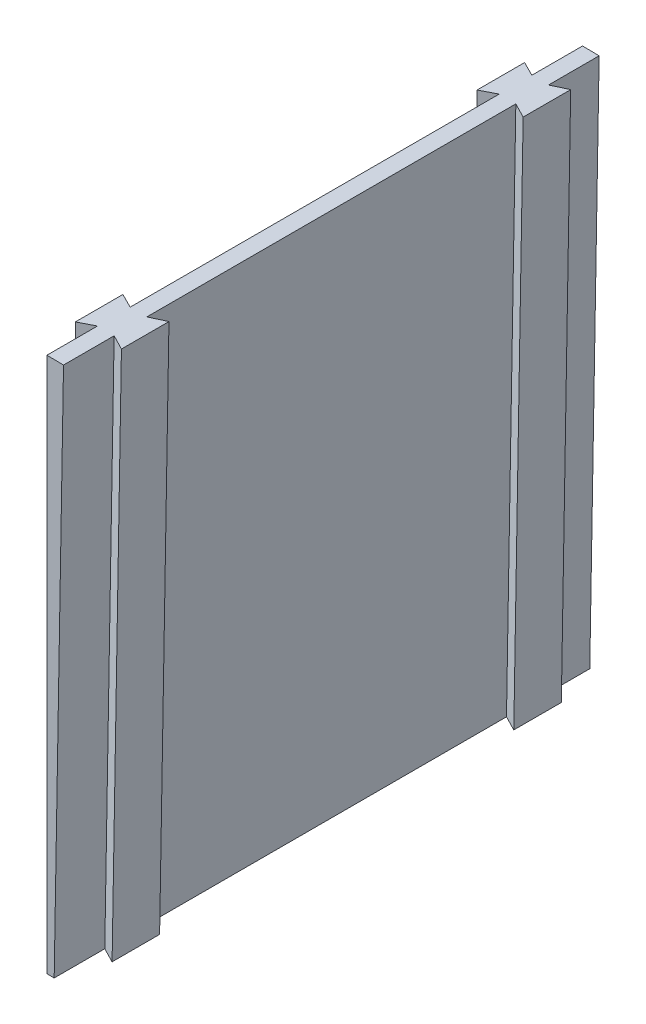
ISO-10303-21;
HEADER;
FILE_DESCRIPTION(('STEP AP214'),'2;1');
FILE_NAME('part.step','',(''),(''),'','','');
FILE_SCHEMA(('AUTOMOTIVE_DESIGN { 1 0 10303 214 1 1 1 1 }'));
ENDSEC;
DATA;
#1=APPLICATION_CONTEXT('core data for automotive mechanical design processes');
#2=APPLICATION_PROTOCOL_DEFINITION('international standard','automotive_design',2000,#1);
#3=PRODUCT_CONTEXT('',#1,'mechanical');
#4=PRODUCT('Part','Part','',(#3));
#5=PRODUCT_RELATED_PRODUCT_CATEGORY('part','',(#4));
#6=PRODUCT_DEFINITION_FORMATION('','',#4);
#7=PRODUCT_DEFINITION_CONTEXT('part definition',#1,'design');
#8=PRODUCT_DEFINITION('design','',#6,#7);
#9=PRODUCT_DEFINITION_SHAPE('','',#8);
#10=(LENGTH_UNIT() NAMED_UNIT(*) SI_UNIT(.MILLI.,.METRE.));
#11=(NAMED_UNIT(*) PLANE_ANGLE_UNIT() SI_UNIT($,.RADIAN.));
#12=(NAMED_UNIT(*) SI_UNIT($,.STERADIAN.) SOLID_ANGLE_UNIT());
#13=UNCERTAINTY_MEASURE_WITH_UNIT(LENGTH_MEASURE(1.E-05),#10,'distance_accuracy_value','');
#14=(GEOMETRIC_REPRESENTATION_CONTEXT(3) GLOBAL_UNCERTAINTY_ASSIGNED_CONTEXT((#13)) GLOBAL_UNIT_ASSIGNED_CONTEXT((#10,
#11,#12)) REPRESENTATION_CONTEXT('',''));
#15=CARTESIAN_POINT('',(0.,0.,0.));
#16=DIRECTION('',(0.,0.,1.));
#17=DIRECTION('',(1.,0.,0.));
#18=AXIS2_PLACEMENT_3D('',#15,#16,#17);
#19=CARTESIAN_POINT('',(0.,79.375,101.6));
#20=DIRECTION('',(1.,0.,0.));
#21=DIRECTION('',(0.,0.,-1.));
#22=AXIS2_PLACEMENT_3D('',#19,#20,#21);
#23=PLANE('',#22);
#24=DIRECTION('',(0.,0.,-1.));
#25=VECTOR('',#24,1.);
#26=CARTESIAN_POINT('',(0.,180.975,101.6));
#27=LINE('',#26,#25);
#28=CARTESIAN_POINT('',(0.,180.975,85.7997919351432));
#29=VERTEX_POINT('',#28);
#30=CARTESIAN_POINT('',(0.,180.975,15.8002080648568));
#31=VERTEX_POINT('',#30);
#32=EDGE_CURVE('E191',#29,#31,#27,.T.);
#33=ORIENTED_EDGE('',*,*,#32,.T.);
#34=DIRECTION('',(0.,-1.,0.));
#35=VECTOR('',#34,1.);
#36=CARTESIAN_POINT('',(0.,180.976,15.8002080648568));
#37=LINE('',#36,#35);
#38=CARTESIAN_POINT('',(0.,79.375,15.8002080648568));
#39=VERTEX_POINT('',#38);
#40=EDGE_CURVE('E68',#31,#39,#37,.T.);
#41=ORIENTED_EDGE('',*,*,#40,.T.);
#42=DIRECTION('',(0.,0.,-1.));
#43=VECTOR('',#42,1.);
#44=CARTESIAN_POINT('',(0.,79.375,101.6));
#45=LINE('',#44,#43);
#46=CARTESIAN_POINT('',(0.,79.375,85.7997919351432));
#47=VERTEX_POINT('',#46);
#48=EDGE_CURVE('E363',#47,#39,#45,.T.);
#49=ORIENTED_EDGE('',*,*,#48,.F.);
#50=DIRECTION('',(0.,-1.,0.));
#51=VECTOR('',#50,1.);
#52=CARTESIAN_POINT('',(0.,180.976,85.7997919351432));
#53=LINE('',#52,#51);
#54=EDGE_CURVE('E221',#29,#47,#53,.T.);
#55=ORIENTED_EDGE('',*,*,#54,.F.);
#56=EDGE_LOOP('',(#33,#41,#49,#55));
#57=FACE_BOUND('',#56,.T.);
#58=ADVANCED_FACE('F43',(#57),#23,.F.);
#59=CARTESIAN_POINT('',(0.,79.375,9.59979193514321));
#60=VERTEX_POINT('',#59);
#61=CARTESIAN_POINT('',(0.,79.375,0.));
#62=VERTEX_POINT('',#61);
#63=EDGE_CURVE('E60',#60,#62,#45,.T.);
#64=ORIENTED_EDGE('',*,*,#63,.F.);
#65=DIRECTION('',(0.,-1.,0.));
#66=VECTOR('',#65,1.);
#67=CARTESIAN_POINT('',(0.,180.976,9.59979193514321));
#68=LINE('',#67,#66);
#69=CARTESIAN_POINT('',(0.,180.975,9.59979193514321));
#70=VERTEX_POINT('',#69);
#71=EDGE_CURVE('E196',#70,#60,#68,.T.);
#72=ORIENTED_EDGE('',*,*,#71,.F.);
#73=CARTESIAN_POINT('',(0.,180.975,0.));
#74=VERTEX_POINT('',#73);
#75=EDGE_CURVE('E182',#70,#74,#27,.T.);
#76=ORIENTED_EDGE('',*,*,#75,.T.);
#77=DIRECTION('',(0.,-1.,0.));
#78=VECTOR('',#77,1.);
#79=CARTESIAN_POINT('',(0.,79.375,0.));
#80=LINE('',#79,#78);
#81=EDGE_CURVE('E341',#74,#62,#80,.T.);
#82=ORIENTED_EDGE('',*,*,#81,.T.);
#83=EDGE_LOOP('',(#64,#72,#76,#82));
#84=FACE_BOUND('',#83,.T.);
#85=ADVANCED_FACE('F197',(#84),#23,.F.);
#86=CARTESIAN_POINT('',(1.38528476095938,79.3629108030386,101.6));
#87=DIRECTION('',(-0.999847695156391,0.0174524064372836,0.));
#88=DIRECTION('',(-0.0174524064372836,-0.999847695156391,0.));
#89=AXIS2_PLACEMENT_3D('',#86,#87,#88);
#90=PLANE('',#89);
#91=DIRECTION('',(0.,0.,-1.));
#92=VECTOR('',#91,1.);
#93=CARTESIAN_POINT('',(1.38528476095938,79.3629108030386,101.6));
#94=LINE('',#93,#92);
#95=CARTESIAN_POINT('',(1.38528476095938,79.3629108030386,85.7997919351432));
#96=VERTEX_POINT('',#95);
#97=CARTESIAN_POINT('',(1.38528476095938,79.3629108030386,15.8002080648568));
#98=VERTEX_POINT('',#97);
#99=EDGE_CURVE('E52',#96,#98,#94,.T.);
#100=ORIENTED_EDGE('',*,*,#99,.T.);
#101=DIRECTION('',(-0.0174524064372835,-0.999847695156391,0.));
#102=VECTOR('',#101,1.);
#103=CARTESIAN_POINT('',(3.15930013999314,180.996183800259,15.8002080648568));
#104=LINE('',#103,#102);
#105=CARTESIAN_POINT('',(3.1584492549874,180.947436630928,15.8002080648568));
#106=VERTEX_POINT('',#105);
#107=EDGE_CURVE('E258',#106,#98,#104,.T.);
#108=ORIENTED_EDGE('',*,*,#107,.F.);
#109=DIRECTION('',(0.,0.,-1.));
#110=VECTOR('',#109,1.);
#111=CARTESIAN_POINT('',(3.15844925498738,180.947436630928,101.6));
#112=LINE('',#111,#110);
#113=CARTESIAN_POINT('',(3.15844925498738,180.947436630928,85.7997919351432));
#114=VERTEX_POINT('',#113);
#115=EDGE_CURVE('E369',#114,#106,#112,.T.);
#116=ORIENTED_EDGE('',*,*,#115,.F.);
#117=DIRECTION('',(-0.0174524064372835,-0.999847695156391,0.));
#118=VECTOR('',#117,1.);
#119=CARTESIAN_POINT('',(3.15930013999314,180.996183800259,85.7997919351432));
#120=LINE('',#119,#118);
#121=EDGE_CURVE('E320',#114,#96,#120,.T.);
#122=ORIENTED_EDGE('',*,*,#121,.T.);
#123=EDGE_LOOP('',(#100,#108,#116,#122));
#124=FACE_BOUND('',#123,.T.);
#125=ADVANCED_FACE('F470',(#124),#90,.F.);
#126=DIRECTION('',(-0.0174524064372835,-0.999847695156391,0.));
#127=VECTOR('',#126,1.);
#128=CARTESIAN_POINT('',(3.15930013999314,180.996183800259,92.0002080648568));
#129=LINE('',#128,#127);
#130=CARTESIAN_POINT('',(3.15844925498738,180.947436630928,92.0002080648568));
#131=VERTEX_POINT('',#130);
#132=CARTESIAN_POINT('',(1.38528476095938,79.3629108030386,92.0002080648568));
#133=VERTEX_POINT('',#132);
#134=EDGE_CURVE('E301',#131,#133,#129,.T.);
#135=ORIENTED_EDGE('',*,*,#134,.F.);
#136=CARTESIAN_POINT('',(3.15844925498738,180.947436630928,101.6));
#137=VERTEX_POINT('',#136);
#138=EDGE_CURVE('E366',#137,#131,#112,.T.);
#139=ORIENTED_EDGE('',*,*,#138,.F.);
#140=DIRECTION('',(0.0174524064372836,0.999847695156391,0.));
#141=VECTOR('',#140,1.);
#142=CARTESIAN_POINT('',(1.38528476095938,79.3629108030386,101.6));
#143=LINE('',#142,#141);
#144=CARTESIAN_POINT('',(1.38528476095938,79.3629108030386,101.6));
#145=VERTEX_POINT('',#144);
#146=EDGE_CURVE('E340',#145,#137,#143,.T.);
#147=ORIENTED_EDGE('',*,*,#146,.F.);
#148=EDGE_CURVE('E11',#145,#133,#94,.T.);
#149=ORIENTED_EDGE('',*,*,#148,.T.);
#150=EDGE_LOOP('',(#135,#139,#147,#149));
#151=FACE_BOUND('',#150,.T.);
#152=ADVANCED_FACE('F449',(#151),#90,.F.);
#153=CARTESIAN_POINT('',(0.,0.,101.6));
#154=DIRECTION('',(0.,0.,-1.));
#155=DIRECTION('',(-1.,0.,0.));
#156=AXIS2_PLACEMENT_3D('',#153,#154,#155);
#157=CYLINDRICAL_SURFACE('',#156,79.375);
#158=CARTESIAN_POINT('',(0.,0.,0.));
#159=DIRECTION('',(0.,0.,-1.));
#160=DIRECTION('',(-1.,0.,0.));
#161=AXIS2_PLACEMENT_3D('',#158,#159,#160);
#162=CIRCLE('',#161,79.375);
#163=CARTESIAN_POINT('',(1.38528476095938,79.3629108030386,0.));
#164=VERTEX_POINT('',#163);
#165=EDGE_CURVE('E335',#62,#164,#162,.T.);
#166=ORIENTED_EDGE('',*,*,#165,.T.);
#167=CARTESIAN_POINT('',(1.38528476095938,79.3629108030386,9.59979193514321));
#168=VERTEX_POINT('',#167);
#169=EDGE_CURVE('E53',#168,#164,#94,.T.);
#170=ORIENTED_EDGE('',*,*,#169,.F.);
#171=DIRECTION('',(0.,0.,-1.));
#172=VECTOR('',#171,1.);
#173=CARTESIAN_POINT('',(1.38528476095938,79.3629108030386,15.8002080648568));
#174=LINE('',#173,#172);
#175=EDGE_CURVE('E280',#98,#168,#174,.T.);
#176=ORIENTED_EDGE('',*,*,#175,.F.);
#177=ORIENTED_EDGE('',*,*,#99,.F.);
#178=DIRECTION('',(0.,0.,-1.));
#179=VECTOR('',#178,1.);
#180=CARTESIAN_POINT('',(1.38528476095938,79.3629108030386,85.7997919351432));
#181=LINE('',#180,#179);
#182=EDGE_CURVE('E288',#133,#96,#181,.T.);
#183=ORIENTED_EDGE('',*,*,#182,.F.);
#184=ORIENTED_EDGE('',*,*,#148,.F.);
#185=CARTESIAN_POINT('',(0.,0.,101.6));
#186=DIRECTION('',(0.,0.,-1.));
#187=DIRECTION('',(-1.,0.,0.));
#188=AXIS2_PLACEMENT_3D('',#185,#186,#187);
#189=CIRCLE('',#188,79.375);
#190=CARTESIAN_POINT('',(0.,79.375,101.6));
#191=VERTEX_POINT('',#190);
#192=EDGE_CURVE('E336',#191,#145,#189,.T.);
#193=ORIENTED_EDGE('',*,*,#192,.F.);
#194=CARTESIAN_POINT('',(0.,79.375,92.0002080648568));
#195=VERTEX_POINT('',#194);
#196=EDGE_CURVE('E192',#191,#195,#45,.T.);
#197=ORIENTED_EDGE('',*,*,#196,.T.);
#198=DIRECTION('',(0.,0.,1.));
#199=VECTOR('',#198,1.);
#200=CARTESIAN_POINT('',(0.,79.375,85.7997919351432));
#201=LINE('',#200,#199);
#202=EDGE_CURVE('E225',#47,#195,#201,.T.);
#203=ORIENTED_EDGE('',*,*,#202,.F.);
#204=ORIENTED_EDGE('',*,*,#48,.T.);
#205=DIRECTION('',(0.,0.,1.));
#206=VECTOR('',#205,1.);
#207=CARTESIAN_POINT('',(0.,79.375,15.8002080648568));
#208=LINE('',#207,#206);
#209=EDGE_CURVE('E389',#60,#39,#208,.T.);
#210=ORIENTED_EDGE('',*,*,#209,.F.);
#211=ORIENTED_EDGE('',*,*,#63,.T.);
#212=EDGE_LOOP('',(#166,#170,#176,#177,#183,#184,#193,#197,#203,#204,#210,#211));
#213=FACE_BOUND('',#212,.T.);
#214=ADVANCED_FACE('F45',(#213),#157,.F.);
#215=CARTESIAN_POINT('',(3.15844925498738,180.947436630928,9.59979193514321));
#216=VERTEX_POINT('',#215);
#217=CARTESIAN_POINT('',(3.15844925498738,180.947436630928,0.));
#218=VERTEX_POINT('',#217);
#219=EDGE_CURVE('E365',#216,#218,#112,.T.);
#220=ORIENTED_EDGE('',*,*,#219,.F.);
#221=DIRECTION('',(-0.0174524064372835,-0.999847695156391,0.));
#222=VECTOR('',#221,1.);
#223=CARTESIAN_POINT('',(3.15930013999314,180.996183800259,9.59979193514321));
#224=LINE('',#223,#222);
#225=EDGE_CURVE('E262',#216,#168,#224,.T.);
#226=ORIENTED_EDGE('',*,*,#225,.T.);
#227=ORIENTED_EDGE('',*,*,#169,.T.);
#228=DIRECTION('',(0.0174524064372836,0.999847695156391,0.));
#229=VECTOR('',#228,1.);
#230=CARTESIAN_POINT('',(1.38528476095938,79.3629108030386,0.));
#231=LINE('',#230,#229);
#232=EDGE_CURVE('E353',#164,#218,#231,.T.);
#233=ORIENTED_EDGE('',*,*,#232,.T.);
#234=EDGE_LOOP('',(#220,#226,#227,#233));
#235=FACE_BOUND('',#234,.T.);
#236=ADVANCED_FACE('F381',(#235),#90,.F.);
#237=CARTESIAN_POINT('',(0.,0.,101.6));
#238=DIRECTION('',(0.,0.,-1.));
#239=DIRECTION('',(-1.,0.,0.));
#240=AXIS2_PLACEMENT_3D('',#237,#238,#239);
#241=CYLINDRICAL_SURFACE('',#240,180.975);
#242=CARTESIAN_POINT('',(0.,0.,0.));
#243=DIRECTION('',(0.,0.,1.));
#244=DIRECTION('',(-1.,0.,0.));
#245=AXIS2_PLACEMENT_3D('',#242,#243,#244);
#246=CIRCLE('',#245,180.975);
#247=EDGE_CURVE('E188',#218,#74,#246,.T.);
#248=ORIENTED_EDGE('',*,*,#247,.T.);
#249=ORIENTED_EDGE('',*,*,#75,.F.);
#250=CARTESIAN_POINT('',(0.,0.,9.59979193514321));
#251=DIRECTION('',(0.450153111117083,0.,-0.892951385323754));
#252=DIRECTION('',(-0.892951385323754,0.,-0.450153111117083));
#253=AXIS2_PLACEMENT_3D('',#250,#251,#252);
#254=ELLIPSE('',#253,202.670607800653,180.975);
#255=CARTESIAN_POINT('',(-2.79357446026696,180.9534375654,8.1915));
#256=VERTEX_POINT('',#255);
#257=EDGE_CURVE('E185',#70,#256,#254,.F.);
#258=ORIENTED_EDGE('',*,*,#257,.T.);
#259=DIRECTION('',(0.,0.,-1.));
#260=VECTOR('',#259,1.);
#261=CARTESIAN_POINT('',(-2.79357446026696,180.9534375654,101.6));
#262=LINE('',#261,#260);
#263=CARTESIAN_POINT('',(-2.79357446026696,180.9534375654,17.2085));
#264=VERTEX_POINT('',#263);
#265=EDGE_CURVE('E213',#256,#264,#262,.F.);
#266=ORIENTED_EDGE('',*,*,#265,.T.);
#267=CARTESIAN_POINT('',(0.,0.,15.8002080648568));
#268=DIRECTION('',(0.450153111117083,0.,0.892951385323754));
#269=DIRECTION('',(0.892951385323754,0.,-0.450153111117083));
#270=AXIS2_PLACEMENT_3D('',#267,#268,#269);
#271=ELLIPSE('',#270,202.670607800653,180.975);
#272=EDGE_CURVE('E207',#264,#31,#271,.F.);
#273=ORIENTED_EDGE('',*,*,#272,.T.);
#274=ORIENTED_EDGE('',*,*,#32,.F.);
#275=CARTESIAN_POINT('',(0.,0.,85.7997919351432));
#276=DIRECTION('',(0.450153111117083,0.,-0.892951385323754));
#277=DIRECTION('',(-0.892951385323754,0.,-0.450153111117083));
#278=AXIS2_PLACEMENT_3D('',#275,#276,#277);
#279=ELLIPSE('',#278,202.670607800653,180.975);
#280=CARTESIAN_POINT('',(-2.79357446026696,180.9534375654,84.3915));
#281=VERTEX_POINT('',#280);
#282=EDGE_CURVE('E220',#29,#281,#279,.F.);
#283=ORIENTED_EDGE('',*,*,#282,.T.);
#284=DIRECTION('',(0.,0.,-1.));
#285=VECTOR('',#284,1.);
#286=CARTESIAN_POINT('',(-2.79357446026696,180.9534375654,101.6));
#287=LINE('',#286,#285);
#288=CARTESIAN_POINT('',(-2.79357446026696,180.9534375654,93.4085));
#289=VERTEX_POINT('',#288);
#290=EDGE_CURVE('E217',#281,#289,#287,.F.);
#291=ORIENTED_EDGE('',*,*,#290,.T.);
#292=CARTESIAN_POINT('',(0.,0.,92.0002080648568));
#293=DIRECTION('',(0.450153111117083,0.,0.892951385323754));
#294=DIRECTION('',(0.892951385323754,0.,-0.450153111117083));
#295=AXIS2_PLACEMENT_3D('',#292,#293,#294);
#296=ELLIPSE('',#295,202.670607800653,180.975);
#297=CARTESIAN_POINT('',(0.,180.975,92.0002080648568));
#298=VERTEX_POINT('',#297);
#299=EDGE_CURVE('E224',#289,#298,#296,.F.);
#300=ORIENTED_EDGE('',*,*,#299,.T.);
#301=CARTESIAN_POINT('',(0.,180.975,101.6));
#302=VERTEX_POINT('',#301);
#303=EDGE_CURVE('E194',#302,#298,#27,.T.);
#304=ORIENTED_EDGE('',*,*,#303,.F.);
#305=CARTESIAN_POINT('',(0.,0.,101.6));
#306=DIRECTION('',(0.,0.,1.));
#307=DIRECTION('',(-1.,0.,0.));
#308=AXIS2_PLACEMENT_3D('',#305,#306,#307);
#309=CIRCLE('',#308,180.975);
#310=EDGE_CURVE('E344',#137,#302,#309,.T.);
#311=ORIENTED_EDGE('',*,*,#310,.F.);
#312=ORIENTED_EDGE('',*,*,#138,.T.);
#313=CARTESIAN_POINT('',(0.,0.,92.0002080648568));
#314=DIRECTION('',(-0.450029888864767,0.00785530092977308,0.892978943411135));
#315=DIRECTION('',(-0.892842938392813,0.0155846314603472,-0.450098441037438));
#316=AXIS2_PLACEMENT_3D('',#313,#314,#315);
#317=ELLIPSE('',#316,202.664353213845,180.975);
#318=CARTESIAN_POINT('',(5.95164728421928,180.877108887787,93.4085));
#319=VERTEX_POINT('',#318);
#320=EDGE_CURVE('E300',#131,#319,#317,.F.);
#321=ORIENTED_EDGE('',*,*,#320,.T.);
#322=DIRECTION('',(0.,0.,-1.));
#323=VECTOR('',#322,1.);
#324=CARTESIAN_POINT('',(5.95164728421928,180.877108887787,101.6));
#325=LINE('',#324,#323);
#326=CARTESIAN_POINT('',(5.95164728421928,180.877108887787,84.3915));
#327=VERTEX_POINT('',#326);
#328=EDGE_CURVE('E297',#319,#327,#325,.T.);
#329=ORIENTED_EDGE('',*,*,#328,.T.);
#330=CARTESIAN_POINT('',(0.,0.,85.7997919351432));
#331=DIRECTION('',(-0.450029888864767,0.00785530092977308,-0.892978943411135));
#332=DIRECTION('',(0.892842938392813,-0.0155846314603472,-0.450098441037438));
#333=AXIS2_PLACEMENT_3D('',#330,#331,#332);
#334=ELLIPSE('',#333,202.664353213845,180.975);
#335=EDGE_CURVE('E304',#327,#114,#334,.F.);
#336=ORIENTED_EDGE('',*,*,#335,.T.);
#337=ORIENTED_EDGE('',*,*,#115,.T.);
#338=CARTESIAN_POINT('',(0.,0.,15.8002080648568));
#339=DIRECTION('',(-0.450029888864767,0.00785530092977308,0.892978943411135));
#340=DIRECTION('',(-0.892842938392813,0.0155846314603472,-0.450098441037438));
#341=AXIS2_PLACEMENT_3D('',#338,#339,#340);
#342=ELLIPSE('',#341,202.664353213845,180.975);
#343=CARTESIAN_POINT('',(5.95164728421928,180.877108887787,17.2085));
#344=VERTEX_POINT('',#343);
#345=EDGE_CURVE('E257',#106,#344,#342,.F.);
#346=ORIENTED_EDGE('',*,*,#345,.T.);
#347=DIRECTION('',(0.,0.,-1.));
#348=VECTOR('',#347,1.);
#349=CARTESIAN_POINT('',(5.95164728421928,180.877108887787,101.6));
#350=LINE('',#349,#348);
#351=CARTESIAN_POINT('',(5.95164728421928,180.877108887787,8.1915));
#352=VERTEX_POINT('',#351);
#353=EDGE_CURVE('E291',#344,#352,#350,.T.);
#354=ORIENTED_EDGE('',*,*,#353,.T.);
#355=CARTESIAN_POINT('',(0.,0.,9.59979193514321));
#356=DIRECTION('',(-0.450029888864767,0.00785530092977308,-0.892978943411135));
#357=DIRECTION('',(0.892842938392813,-0.0155846314603472,-0.450098441037438));
#358=AXIS2_PLACEMENT_3D('',#355,#356,#357);
#359=ELLIPSE('',#358,202.664353213845,180.975);
#360=EDGE_CURVE('E272',#352,#216,#359,.F.);
#361=ORIENTED_EDGE('',*,*,#360,.T.);
#362=ORIENTED_EDGE('',*,*,#219,.T.);
#363=EDGE_LOOP('',(#248,#249,#258,#266,#273,#274,#283,#291,#300,#304,#311,#312,#321,#329,#336,
#337,#346,#354,#361,#362));
#364=FACE_BOUND('',#363,.T.);
#365=ADVANCED_FACE('F183',(#364),#241,.T.);
#366=ORIENTED_EDGE('',*,*,#303,.T.);
#367=DIRECTION('',(0.,-1.,0.));
#368=VECTOR('',#367,1.);
#369=CARTESIAN_POINT('',(0.,180.976,92.0002080648568));
#370=LINE('',#369,#368);
#371=EDGE_CURVE('E242',#298,#195,#370,.T.);
#372=ORIENTED_EDGE('',*,*,#371,.T.);
#373=ORIENTED_EDGE('',*,*,#196,.F.);
#374=DIRECTION('',(0.,-1.,0.));
#375=VECTOR('',#374,1.);
#376=CARTESIAN_POINT('',(0.,79.375,101.6));
#377=LINE('',#376,#375);
#378=EDGE_CURVE('E347',#302,#191,#377,.T.);
#379=ORIENTED_EDGE('',*,*,#378,.F.);
#380=EDGE_LOOP('',(#366,#372,#373,#379));
#381=FACE_BOUND('',#380,.T.);
#382=ADVANCED_FACE('F443',(#381),#23,.F.);
#383=CARTESIAN_POINT('',(0.,0.,101.6));
#384=DIRECTION('',(0.,0.,-1.));
#385=DIRECTION('',(-1.,0.,0.));
#386=AXIS2_PLACEMENT_3D('',#383,#384,#385);
#387=PLANE('',#386);
#388=ORIENTED_EDGE('',*,*,#192,.T.);
#389=ORIENTED_EDGE('',*,*,#146,.T.);
#390=ORIENTED_EDGE('',*,*,#310,.T.);
#391=ORIENTED_EDGE('',*,*,#378,.T.);
#392=EDGE_LOOP('',(#388,#389,#390,#391));
#393=FACE_BOUND('',#392,.T.);
#394=ADVANCED_FACE('F446',(#393),#387,.F.);
#395=CARTESIAN_POINT('',(0.,0.,0.));
#396=DIRECTION('',(0.,0.,-1.));
#397=DIRECTION('',(-1.,0.,0.));
#398=AXIS2_PLACEMENT_3D('',#395,#396,#397);
#399=PLANE('',#398);
#400=ORIENTED_EDGE('',*,*,#165,.F.);
#401=ORIENTED_EDGE('',*,*,#81,.F.);
#402=ORIENTED_EDGE('',*,*,#247,.F.);
#403=ORIENTED_EDGE('',*,*,#232,.F.);
#404=EDGE_LOOP('',(#400,#401,#402,#403));
#405=FACE_BOUND('',#404,.T.);
#406=ADVANCED_FACE('F385',(#405),#399,.T.);
#407=CARTESIAN_POINT('',(3.15930013999314,180.996183800259,92.0002080648568));
#408=DIRECTION('',(-0.450029888864767,0.00785530092977308,0.892978943411135));
#409=DIRECTION('',(0.893006495655164,0.,0.45004377422389));
#410=AXIS2_PLACEMENT_3D('',#407,#408,#409);
#411=PLANE('',#410);
#412=ORIENTED_EDGE('',*,*,#320,.F.);
#413=ORIENTED_EDGE('',*,*,#134,.T.);
#414=DIRECTION('',(-0.892842938392813,0.0155846314603458,-0.450098441037438));
#415=VECTOR('',#414,1.);
#416=CARTESIAN_POINT('',(1.38528476095938,79.3629108030386,92.0002080648568));
#417=LINE('',#416,#415);
#418=CARTESIAN_POINT('',(4.17885922122634,79.3141487794528,93.4085));
#419=VERTEX_POINT('',#418);
#420=EDGE_CURVE('E316',#419,#133,#417,.T.);
#421=ORIENTED_EDGE('',*,*,#420,.F.);
#422=DIRECTION('',(-0.0174524064372835,-0.999847695156391,0.));
#423=VECTOR('',#422,1.);
#424=CARTESIAN_POINT('',(5.9528746002601,180.947421776674,93.4085));
#425=LINE('',#424,#423);
#426=EDGE_CURVE('E324',#319,#419,#425,.T.);
#427=ORIENTED_EDGE('',*,*,#426,.F.);
#428=EDGE_LOOP('',(#412,#413,#421,#427));
#429=FACE_BOUND('',#428,.T.);
#430=ADVANCED_FACE('F453',(#429),#411,.T.);
#431=CARTESIAN_POINT('',(5.9528746002601,180.947421776674,84.3915));
#432=DIRECTION('',(-0.450029888864767,0.00785530092977308,-0.892978943411135));
#433=DIRECTION('',(-0.893006495655164,0.,0.45004377422389));
#434=AXIS2_PLACEMENT_3D('',#431,#432,#433);
#435=PLANE('',#434);
#436=ORIENTED_EDGE('',*,*,#335,.F.);
#437=DIRECTION('',(-0.0174524064372835,-0.999847695156391,0.));
#438=VECTOR('',#437,1.);
#439=CARTESIAN_POINT('',(5.9528746002601,180.947421776674,84.3915));
#440=LINE('',#439,#438);
#441=CARTESIAN_POINT('',(4.17885922122634,79.3141487794528,84.3915));
#442=VERTEX_POINT('',#441);
#443=EDGE_CURVE('E327',#327,#442,#440,.T.);
#444=ORIENTED_EDGE('',*,*,#443,.T.);
#445=DIRECTION('',(0.892842938392813,-0.0155846314603458,-0.450098441037438));
#446=VECTOR('',#445,1.);
#447=CARTESIAN_POINT('',(4.17885922122634,79.3141487794528,84.3915));
#448=LINE('',#447,#446);
#449=EDGE_CURVE('E308',#96,#442,#448,.T.);
#450=ORIENTED_EDGE('',*,*,#449,.F.);
#451=ORIENTED_EDGE('',*,*,#121,.F.);
#452=EDGE_LOOP('',(#436,#444,#450,#451));
#453=FACE_BOUND('',#452,.T.);
#454=ADVANCED_FACE('F466',(#453),#435,.T.);
#455=CARTESIAN_POINT('',(5.9528746002601,180.947421776674,93.4085));
#456=DIRECTION('',(0.999847695156391,-0.0174524064372835,0.));
#457=DIRECTION('',(0.0174524064372836,0.999847695156391,0.));
#458=AXIS2_PLACEMENT_3D('',#455,#456,#457);
#459=PLANE('',#458);
#460=ORIENTED_EDGE('',*,*,#328,.F.);
#461=ORIENTED_EDGE('',*,*,#426,.T.);
#462=DIRECTION('',(0.,0.,1.));
#463=VECTOR('',#462,1.);
#464=CARTESIAN_POINT('',(4.17885922122634,79.3141487794528,93.4085));
#465=LINE('',#464,#463);
#466=EDGE_CURVE('E312',#442,#419,#465,.T.);
#467=ORIENTED_EDGE('',*,*,#466,.F.);
#468=ORIENTED_EDGE('',*,*,#443,.F.);
#469=EDGE_LOOP('',(#460,#461,#467,#468));
#470=FACE_BOUND('',#469,.T.);
#471=ADVANCED_FACE('F462',(#470),#459,.T.);
#472=CARTESIAN_POINT('',(1.38528476095926,79.3629108030386,0.));
#473=DIRECTION('',(0.0174524064372821,0.999847695156391,0.));
#474=DIRECTION('',(-0.999847695156391,0.0174524064372821,0.));
#475=AXIS2_PLACEMENT_3D('',#472,#473,#474);
#476=PLANE('',#475);
#477=ORIENTED_EDGE('',*,*,#182,.T.);
#478=ORIENTED_EDGE('',*,*,#449,.T.);
#479=ORIENTED_EDGE('',*,*,#466,.T.);
#480=ORIENTED_EDGE('',*,*,#420,.T.);
#481=EDGE_LOOP('',(#477,#478,#479,#480));
#482=FACE_BOUND('',#481,.T.);
#483=ADVANCED_FACE('F456',(#482),#476,.F.);
#484=CARTESIAN_POINT('',(5.9528746002601,180.947421776674,17.2085));
#485=DIRECTION('',(-0.450029888864767,0.00785530092977308,0.892978943411135));
#486=DIRECTION('',(0.893006495655164,0.,0.45004377422389));
#487=AXIS2_PLACEMENT_3D('',#484,#485,#486);
#488=PLANE('',#487);
#489=ORIENTED_EDGE('',*,*,#345,.F.);
#490=ORIENTED_EDGE('',*,*,#107,.T.);
#491=DIRECTION('',(-0.892842938392813,0.0155846314603458,-0.450098441037438));
#492=VECTOR('',#491,1.);
#493=CARTESIAN_POINT('',(4.17885922122634,79.3141487794528,17.2085));
#494=LINE('',#493,#492);
#495=CARTESIAN_POINT('',(4.17885922122634,79.3141487794528,17.2085));
#496=VERTEX_POINT('',#495);
#497=EDGE_CURVE('E284',#496,#98,#494,.T.);
#498=ORIENTED_EDGE('',*,*,#497,.F.);
#499=DIRECTION('',(-0.0174524064372835,-0.999847695156391,0.));
#500=VECTOR('',#499,1.);
#501=CARTESIAN_POINT('',(5.9528746002601,180.947421776674,17.2085));
#502=LINE('',#501,#500);
#503=EDGE_CURVE('E269',#344,#496,#502,.T.);
#504=ORIENTED_EDGE('',*,*,#503,.F.);
#505=EDGE_LOOP('',(#489,#490,#498,#504));
#506=FACE_BOUND('',#505,.T.);
#507=ADVANCED_FACE('F485',(#506),#488,.T.);
#508=CARTESIAN_POINT('',(3.15930013999314,180.996183800259,9.59979193514321));
#509=DIRECTION('',(-0.450029888864767,0.00785530092977308,-0.892978943411135));
#510=DIRECTION('',(-0.893006495655164,0.,0.45004377422389));
#511=AXIS2_PLACEMENT_3D('',#508,#509,#510);
#512=PLANE('',#511);
#513=ORIENTED_EDGE('',*,*,#360,.F.);
#514=DIRECTION('',(-0.0174524064372835,-0.999847695156391,0.));
#515=VECTOR('',#514,1.);
#516=CARTESIAN_POINT('',(5.9528746002601,180.947421776674,8.1915));
#517=LINE('',#516,#515);
#518=CARTESIAN_POINT('',(4.17885922122634,79.3141487794528,8.1915));
#519=VERTEX_POINT('',#518);
#520=EDGE_CURVE('E266',#352,#519,#517,.T.);
#521=ORIENTED_EDGE('',*,*,#520,.T.);
#522=DIRECTION('',(0.892842938392813,-0.0155846314603458,-0.450098441037438));
#523=VECTOR('',#522,1.);
#524=CARTESIAN_POINT('',(1.38528476095938,79.3629108030386,9.59979193514321));
#525=LINE('',#524,#523);
#526=EDGE_CURVE('E276',#168,#519,#525,.T.);
#527=ORIENTED_EDGE('',*,*,#526,.F.);
#528=ORIENTED_EDGE('',*,*,#225,.F.);
#529=EDGE_LOOP('',(#513,#521,#527,#528));
#530=FACE_BOUND('',#529,.T.);
#531=ADVANCED_FACE('F478',(#530),#512,.T.);
#532=CARTESIAN_POINT('',(5.9528746002601,180.947421776674,8.1915));
#533=DIRECTION('',(0.999847695156391,-0.0174524064372835,0.));
#534=DIRECTION('',(0.0174524064372836,0.999847695156391,0.));
#535=AXIS2_PLACEMENT_3D('',#532,#533,#534);
#536=PLANE('',#535);
#537=ORIENTED_EDGE('',*,*,#353,.F.);
#538=ORIENTED_EDGE('',*,*,#503,.T.);
#539=DIRECTION('',(0.,0.,1.));
#540=VECTOR('',#539,1.);
#541=CARTESIAN_POINT('',(4.17885922122634,79.3141487794528,8.1915));
#542=LINE('',#541,#540);
#543=EDGE_CURVE('E261',#519,#496,#542,.T.);
#544=ORIENTED_EDGE('',*,*,#543,.F.);
#545=ORIENTED_EDGE('',*,*,#520,.F.);
#546=EDGE_LOOP('',(#537,#538,#544,#545));
#547=FACE_BOUND('',#546,.T.);
#548=ADVANCED_FACE('F482',(#547),#536,.T.);
#549=CARTESIAN_POINT('',(1.38528476095926,79.3629108030386,0.));
#550=DIRECTION('',(-0.0174524064372821,-0.999847695156391,0.));
#551=DIRECTION('',(0.999847695156391,-0.0174524064372821,0.));
#552=AXIS2_PLACEMENT_3D('',#549,#550,#551);
#553=PLANE('',#552);
#554=ORIENTED_EDGE('',*,*,#497,.T.);
#555=ORIENTED_EDGE('',*,*,#175,.T.);
#556=ORIENTED_EDGE('',*,*,#526,.T.);
#557=ORIENTED_EDGE('',*,*,#543,.T.);
#558=EDGE_LOOP('',(#554,#555,#556,#557));
#559=FACE_BOUND('',#558,.T.);
#560=ADVANCED_FACE('F474',(#559),#553,.T.);
#561=CARTESIAN_POINT('',(-2.79357446026696,180.976,84.3915));
#562=DIRECTION('',(0.450153111117083,0.,-0.892951385323754));
#563=DIRECTION('',(-0.892951385323754,0.,-0.450153111117083));
#564=AXIS2_PLACEMENT_3D('',#561,#562,#563);
#565=PLANE('',#564);
#566=ORIENTED_EDGE('',*,*,#282,.F.);
#567=ORIENTED_EDGE('',*,*,#54,.T.);
#568=DIRECTION('',(0.892951385323754,0.,0.450153111117083));
#569=VECTOR('',#568,1.);
#570=CARTESIAN_POINT('',(-2.79357446026696,79.375,84.3915));
#571=LINE('',#570,#569);
#572=CARTESIAN_POINT('',(-2.79357446026696,79.375,84.3915));
#573=VERTEX_POINT('',#572);
#574=EDGE_CURVE('E238',#573,#47,#571,.T.);
#575=ORIENTED_EDGE('',*,*,#574,.F.);
#576=DIRECTION('',(0.,-1.,0.));
#577=VECTOR('',#576,1.);
#578=CARTESIAN_POINT('',(-2.79357446026696,180.976,84.3915));
#579=LINE('',#578,#577);
#580=EDGE_CURVE('E246',#281,#573,#579,.T.);
#581=ORIENTED_EDGE('',*,*,#580,.F.);
#582=EDGE_LOOP('',(#566,#567,#575,#581));
#583=FACE_BOUND('',#582,.T.);
#584=ADVANCED_FACE('F426',(#583),#565,.T.);
#585=CARTESIAN_POINT('',(0.,180.976,92.0002080648568));
#586=DIRECTION('',(0.450153111117083,0.,0.892951385323754));
#587=DIRECTION('',(0.892951385323754,0.,-0.450153111117083));
#588=AXIS2_PLACEMENT_3D('',#585,#586,#587);
#589=PLANE('',#588);
#590=ORIENTED_EDGE('',*,*,#299,.F.);
#591=DIRECTION('',(0.,-1.,0.));
#592=VECTOR('',#591,1.);
#593=CARTESIAN_POINT('',(-2.79357446026696,180.976,93.4085));
#594=LINE('',#593,#592);
#595=CARTESIAN_POINT('',(-2.79357446026696,79.375,93.4085));
#596=VERTEX_POINT('',#595);
#597=EDGE_CURVE('E249',#289,#596,#594,.T.);
#598=ORIENTED_EDGE('',*,*,#597,.T.);
#599=DIRECTION('',(-0.892951385323754,0.,0.450153111117083));
#600=VECTOR('',#599,1.);
#601=CARTESIAN_POINT('',(0.,79.375,92.0002080648568));
#602=LINE('',#601,#600);
#603=EDGE_CURVE('E229',#195,#596,#602,.T.);
#604=ORIENTED_EDGE('',*,*,#603,.F.);
#605=ORIENTED_EDGE('',*,*,#371,.F.);
#606=EDGE_LOOP('',(#590,#598,#604,#605));
#607=FACE_BOUND('',#606,.T.);
#608=ADVANCED_FACE('F438',(#607),#589,.T.);
#609=CARTESIAN_POINT('',(-2.79357446026696,180.976,93.4085));
#610=DIRECTION('',(-1.,0.,0.));
#611=DIRECTION('',(0.,0.,1.));
#612=AXIS2_PLACEMENT_3D('',#609,#610,#611);
#613=PLANE('',#612);
#614=ORIENTED_EDGE('',*,*,#290,.F.);
#615=ORIENTED_EDGE('',*,*,#580,.T.);
#616=DIRECTION('',(0.,0.,-1.));
#617=VECTOR('',#616,1.);
#618=CARTESIAN_POINT('',(-2.79357446026696,79.375,93.4085));
#619=LINE('',#618,#617);
#620=EDGE_CURVE('E234',#596,#573,#619,.T.);
#621=ORIENTED_EDGE('',*,*,#620,.F.);
#622=ORIENTED_EDGE('',*,*,#597,.F.);
#623=EDGE_LOOP('',(#614,#615,#621,#622));
#624=FACE_BOUND('',#623,.T.);
#625=ADVANCED_FACE('F430',(#624),#613,.T.);
#626=CARTESIAN_POINT('',(0.,79.375,0.));
#627=DIRECTION('',(0.,-1.,0.));
#628=DIRECTION('',(0.,0.,-1.));
#629=AXIS2_PLACEMENT_3D('',#626,#627,#628);
#630=PLANE('',#629);
#631=ORIENTED_EDGE('',*,*,#202,.T.);
#632=ORIENTED_EDGE('',*,*,#603,.T.);
#633=ORIENTED_EDGE('',*,*,#620,.T.);
#634=ORIENTED_EDGE('',*,*,#574,.T.);
#635=EDGE_LOOP('',(#631,#632,#633,#634));
#636=FACE_BOUND('',#635,.T.);
#637=ADVANCED_FACE('F433',(#636),#630,.T.);
#638=CARTESIAN_POINT('',(-2.79357446026696,180.976,17.2085));
#639=DIRECTION('',(0.450153111117083,0.,0.892951385323754));
#640=DIRECTION('',(0.892951385323754,0.,-0.450153111117083));
#641=AXIS2_PLACEMENT_3D('',#638,#639,#640);
#642=PLANE('',#641);
#643=ORIENTED_EDGE('',*,*,#272,.F.);
#644=DIRECTION('',(0.,-1.,0.));
#645=VECTOR('',#644,1.);
#646=CARTESIAN_POINT('',(-2.79357446026696,180.976,17.2085));
#647=LINE('',#646,#645);
#648=CARTESIAN_POINT('',(-2.79357446026696,79.375,17.2085));
#649=VERTEX_POINT('',#648);
#650=EDGE_CURVE('E398',#264,#649,#647,.T.);
#651=ORIENTED_EDGE('',*,*,#650,.T.);
#652=DIRECTION('',(-0.892951385323754,0.,0.450153111117083));
#653=VECTOR('',#652,1.);
#654=CARTESIAN_POINT('',(-2.79357446026696,79.375,17.2085));
#655=LINE('',#654,#653);
#656=EDGE_CURVE('E230',#39,#649,#655,.T.);
#657=ORIENTED_EDGE('',*,*,#656,.F.);
#658=ORIENTED_EDGE('',*,*,#40,.F.);
#659=EDGE_LOOP('',(#643,#651,#657,#658));
#660=FACE_BOUND('',#659,.T.);
#661=ADVANCED_FACE('F396',(#660),#642,.T.);
#662=CARTESIAN_POINT('',(0.,180.976,9.59979193514321));
#663=DIRECTION('',(0.450153111117083,0.,-0.892951385323754));
#664=DIRECTION('',(-0.892951385323754,0.,-0.450153111117083));
#665=AXIS2_PLACEMENT_3D('',#662,#663,#664);
#666=PLANE('',#665);
#667=ORIENTED_EDGE('',*,*,#257,.F.);
#668=ORIENTED_EDGE('',*,*,#71,.T.);
#669=DIRECTION('',(0.892951385323754,0.,0.450153111117083));
#670=VECTOR('',#669,1.);
#671=CARTESIAN_POINT('',(0.,79.375,9.59979193514321));
#672=LINE('',#671,#670);
#673=CARTESIAN_POINT('',(-2.79357446026696,79.375,8.1915));
#674=VERTEX_POINT('',#673);
#675=EDGE_CURVE('E405',#674,#60,#672,.T.);
#676=ORIENTED_EDGE('',*,*,#675,.F.);
#677=DIRECTION('',(0.,-1.,0.));
#678=VECTOR('',#677,1.);
#679=CARTESIAN_POINT('',(-2.79357446026696,180.976,8.1915));
#680=LINE('',#679,#678);
#681=EDGE_CURVE('E202',#256,#674,#680,.T.);
#682=ORIENTED_EDGE('',*,*,#681,.F.);
#683=EDGE_LOOP('',(#667,#668,#676,#682));
#684=FACE_BOUND('',#683,.T.);
#685=ADVANCED_FACE('F204',(#684),#666,.T.);
#686=CARTESIAN_POINT('',(-2.79357446026696,180.976,8.1915));
#687=DIRECTION('',(-1.,0.,0.));
#688=DIRECTION('',(0.,0.,1.));
#689=AXIS2_PLACEMENT_3D('',#686,#687,#688);
#690=PLANE('',#689);
#691=ORIENTED_EDGE('',*,*,#265,.F.);
#692=ORIENTED_EDGE('',*,*,#681,.T.);
#693=DIRECTION('',(0.,0.,-1.));
#694=VECTOR('',#693,1.);
#695=CARTESIAN_POINT('',(-2.79357446026696,79.375,8.1915));
#696=LINE('',#695,#694);
#697=EDGE_CURVE('E403',#649,#674,#696,.T.);
#698=ORIENTED_EDGE('',*,*,#697,.F.);
#699=ORIENTED_EDGE('',*,*,#650,.F.);
#700=EDGE_LOOP('',(#691,#692,#698,#699));
#701=FACE_BOUND('',#700,.T.);
#702=ADVANCED_FACE('F415',(#701),#690,.T.);
#703=CARTESIAN_POINT('',(0.,79.375,0.));
#704=DIRECTION('',(0.,1.,0.));
#705=DIRECTION('',(0.,0.,1.));
#706=AXIS2_PLACEMENT_3D('',#703,#704,#705);
#707=PLANE('',#706);
#708=ORIENTED_EDGE('',*,*,#656,.T.);
#709=ORIENTED_EDGE('',*,*,#697,.T.);
#710=ORIENTED_EDGE('',*,*,#675,.T.);
#711=ORIENTED_EDGE('',*,*,#209,.T.);
#712=EDGE_LOOP('',(#708,#709,#710,#711));
#713=FACE_BOUND('',#712,.T.);
#714=ADVANCED_FACE('F404',(#713),#707,.F.);
#715=CLOSED_SHELL('',(#58,#85,#125,#152,#214,#236,#365,#382,#394,#406,#430,#454,#471,#483,#507,
#531,#548,#560,#584,#608,#625,#637,#661,#685,#702,#714));
#716=MANIFOLD_SOLID_BREP('B2',#715);
#717=ADVANCED_BREP_SHAPE_REPRESENTATION('',(#18,#716),#14);
#718=SHAPE_DEFINITION_REPRESENTATION(#9,#717);
ENDSEC;
END-ISO-10303-21;
